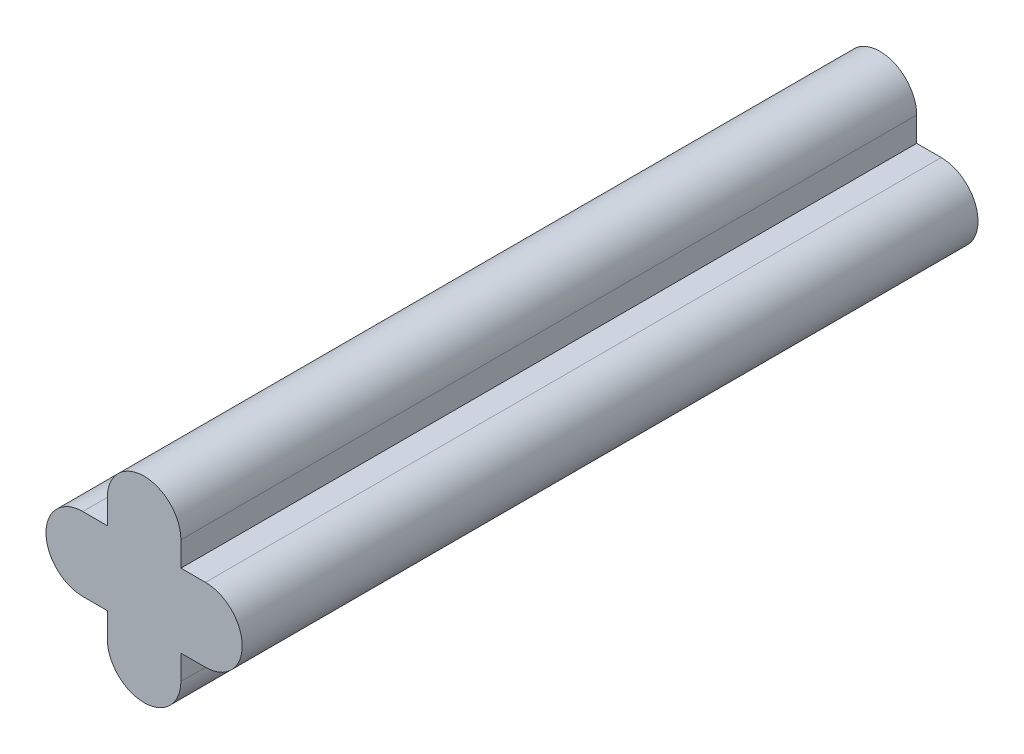
ISO-10303-21;
HEADER;
FILE_DESCRIPTION(('STEP AP214'),'2;1');
FILE_NAME('part.step','',(''),(''),'','','');
FILE_SCHEMA(('AUTOMOTIVE_DESIGN { 1 0 10303 214 1 1 1 1 }'));
ENDSEC;
DATA;
#1=APPLICATION_CONTEXT('core data for automotive mechanical design processes');
#2=APPLICATION_PROTOCOL_DEFINITION('international standard','automotive_design',2000,#1);
#3=PRODUCT_CONTEXT('',#1,'mechanical');
#4=PRODUCT('Part','Part','',(#3));
#5=PRODUCT_RELATED_PRODUCT_CATEGORY('part','',(#4));
#6=PRODUCT_DEFINITION_FORMATION('','',#4);
#7=PRODUCT_DEFINITION_CONTEXT('part definition',#1,'design');
#8=PRODUCT_DEFINITION('design','',#6,#7);
#9=PRODUCT_DEFINITION_SHAPE('','',#8);
#10=(LENGTH_UNIT() NAMED_UNIT(*) SI_UNIT(.MILLI.,.METRE.));
#11=(NAMED_UNIT(*) PLANE_ANGLE_UNIT() SI_UNIT($,.RADIAN.));
#12=(NAMED_UNIT(*) SI_UNIT($,.STERADIAN.) SOLID_ANGLE_UNIT());
#13=UNCERTAINTY_MEASURE_WITH_UNIT(LENGTH_MEASURE(1.E-05),#10,'distance_accuracy_value','');
#14=(GEOMETRIC_REPRESENTATION_CONTEXT(3) GLOBAL_UNCERTAINTY_ASSIGNED_CONTEXT((#13)) GLOBAL_UNIT_ASSIGNED_CONTEXT((#10,
#11,#12)) REPRESENTATION_CONTEXT('',''));
#15=CARTESIAN_POINT('',(0.,0.,0.));
#16=DIRECTION('',(0.,0.,1.));
#17=DIRECTION('',(1.,0.,0.));
#18=AXIS2_PLACEMENT_3D('',#15,#16,#17);
#19=CARTESIAN_POINT('',(-2.5,0.,30.));
#20=DIRECTION('',(0.,0.,-1.));
#21=DIRECTION('',(-1.,0.,0.));
#22=AXIS2_PLACEMENT_3D('',#19,#20,#21);
#23=CYLINDRICAL_SURFACE('',#22,1.5);
#24=CARTESIAN_POINT('',(-2.5,0.,0.));
#25=DIRECTION('',(0.,0.,1.));
#26=DIRECTION('',(1.,0.,0.));
#27=AXIS2_PLACEMENT_3D('',#24,#25,#26);
#28=CIRCLE('',#27,1.5);
#29=CARTESIAN_POINT('',(-2.5,1.5,0.));
#30=VERTEX_POINT('',#29);
#31=CARTESIAN_POINT('',(-2.5,-1.5,0.));
#32=VERTEX_POINT('',#31);
#33=EDGE_CURVE('E164',#30,#32,#28,.T.);
#34=ORIENTED_EDGE('',*,*,#33,.T.);
#35=DIRECTION('',(0.,0.,-1.));
#36=VECTOR('',#35,1.);
#37=CARTESIAN_POINT('',(-2.5,-1.5,30.));
#38=LINE('',#37,#36);
#39=CARTESIAN_POINT('',(-2.5,-1.5,30.));
#40=VERTEX_POINT('',#39);
#41=EDGE_CURVE('E11',#40,#32,#38,.T.);
#42=ORIENTED_EDGE('',*,*,#41,.F.);
#43=CARTESIAN_POINT('',(-2.5,0.,30.));
#44=DIRECTION('',(0.,0.,1.));
#45=DIRECTION('',(1.,0.,0.));
#46=AXIS2_PLACEMENT_3D('',#43,#44,#45);
#47=CIRCLE('',#46,1.5);
#48=CARTESIAN_POINT('',(-2.5,1.5,30.));
#49=VERTEX_POINT('',#48);
#50=EDGE_CURVE('E198',#49,#40,#47,.T.);
#51=ORIENTED_EDGE('',*,*,#50,.F.);
#52=DIRECTION('',(0.,0.,-1.));
#53=VECTOR('',#52,1.);
#54=CARTESIAN_POINT('',(-2.5,1.5,30.));
#55=LINE('',#54,#53);
#56=EDGE_CURVE('E160',#49,#30,#55,.T.);
#57=ORIENTED_EDGE('',*,*,#56,.T.);
#58=EDGE_LOOP('',(#34,#42,#51,#57));
#59=FACE_BOUND('',#58,.T.);
#60=ADVANCED_FACE('F39',(#59),#23,.T.);
#61=CARTESIAN_POINT('',(-2.5,-1.5,30.));
#62=DIRECTION('',(0.,1.,0.));
#63=DIRECTION('',(0.,0.,1.));
#64=AXIS2_PLACEMENT_3D('',#61,#62,#63);
#65=PLANE('',#64);
#66=DIRECTION('',(1.,0.,0.));
#67=VECTOR('',#66,1.);
#68=CARTESIAN_POINT('',(-2.5,-1.5,0.));
#69=LINE('',#68,#67);
#70=CARTESIAN_POINT('',(-1.5,-1.5,0.));
#71=VERTEX_POINT('',#70);
#72=EDGE_CURVE('E168',#32,#71,#69,.T.);
#73=ORIENTED_EDGE('',*,*,#72,.T.);
#74=DIRECTION('',(0.,0.,-1.));
#75=VECTOR('',#74,1.);
#76=CARTESIAN_POINT('',(-1.5,-1.5,30.));
#77=LINE('',#76,#75);
#78=CARTESIAN_POINT('',(-1.5,-1.5,30.));
#79=VERTEX_POINT('',#78);
#80=EDGE_CURVE('E48',#79,#71,#77,.T.);
#81=ORIENTED_EDGE('',*,*,#80,.F.);
#82=DIRECTION('',(1.,0.,0.));
#83=VECTOR('',#82,1.);
#84=CARTESIAN_POINT('',(-2.5,-1.5,30.));
#85=LINE('',#84,#83);
#86=EDGE_CURVE('E111',#40,#79,#85,.T.);
#87=ORIENTED_EDGE('',*,*,#86,.F.);
#88=ORIENTED_EDGE('',*,*,#41,.T.);
#89=EDGE_LOOP('',(#73,#81,#87,#88));
#90=FACE_BOUND('',#89,.T.);
#91=ADVANCED_FACE('F292',(#90),#65,.F.);
#92=CARTESIAN_POINT('',(-1.5,-1.5,30.));
#93=DIRECTION('',(1.,0.,0.));
#94=DIRECTION('',(0.,0.,-1.));
#95=AXIS2_PLACEMENT_3D('',#92,#93,#94);
#96=PLANE('',#95);
#97=DIRECTION('',(0.,-1.,0.));
#98=VECTOR('',#97,1.);
#99=CARTESIAN_POINT('',(-1.5,-1.5,0.));
#100=LINE('',#99,#98);
#101=CARTESIAN_POINT('',(-1.5,-2.5,0.));
#102=VERTEX_POINT('',#101);
#103=EDGE_CURVE('E171',#71,#102,#100,.T.);
#104=ORIENTED_EDGE('',*,*,#103,.T.);
#105=DIRECTION('',(0.,0.,-1.));
#106=VECTOR('',#105,1.);
#107=CARTESIAN_POINT('',(-1.5,-2.5,30.));
#108=LINE('',#107,#106);
#109=CARTESIAN_POINT('',(-1.5,-2.5,30.));
#110=VERTEX_POINT('',#109);
#111=EDGE_CURVE('E225',#110,#102,#108,.T.);
#112=ORIENTED_EDGE('',*,*,#111,.F.);
#113=DIRECTION('',(0.,-1.,0.));
#114=VECTOR('',#113,1.);
#115=CARTESIAN_POINT('',(-1.5,-1.5,30.));
#116=LINE('',#115,#114);
#117=EDGE_CURVE('E235',#79,#110,#116,.T.);
#118=ORIENTED_EDGE('',*,*,#117,.F.);
#119=ORIENTED_EDGE('',*,*,#80,.T.);
#120=EDGE_LOOP('',(#104,#112,#118,#119));
#121=FACE_BOUND('',#120,.T.);
#122=ADVANCED_FACE('F233',(#121),#96,.F.);
#123=CARTESIAN_POINT('',(0.,-2.5,30.));
#124=DIRECTION('',(0.,0.,-1.));
#125=DIRECTION('',(-1.,0.,0.));
#126=AXIS2_PLACEMENT_3D('',#123,#124,#125);
#127=CYLINDRICAL_SURFACE('',#126,1.5);
#128=CARTESIAN_POINT('',(0.,-2.5,0.));
#129=DIRECTION('',(0.,0.,1.));
#130=DIRECTION('',(1.,0.,0.));
#131=AXIS2_PLACEMENT_3D('',#128,#129,#130);
#132=CIRCLE('',#131,1.5);
#133=CARTESIAN_POINT('',(1.5,-2.5,0.));
#134=VERTEX_POINT('',#133);
#135=EDGE_CURVE('E174',#102,#134,#132,.T.);
#136=ORIENTED_EDGE('',*,*,#135,.T.);
#137=DIRECTION('',(0.,0.,-1.));
#138=VECTOR('',#137,1.);
#139=CARTESIAN_POINT('',(1.5,-2.5,30.));
#140=LINE('',#139,#138);
#141=CARTESIAN_POINT('',(1.5,-2.5,30.));
#142=VERTEX_POINT('',#141);
#143=EDGE_CURVE('E221',#142,#134,#140,.T.);
#144=ORIENTED_EDGE('',*,*,#143,.F.);
#145=CARTESIAN_POINT('',(0.,-2.5,30.));
#146=DIRECTION('',(0.,0.,1.));
#147=DIRECTION('',(1.,0.,0.));
#148=AXIS2_PLACEMENT_3D('',#145,#146,#147);
#149=CIRCLE('',#148,1.5);
#150=EDGE_CURVE('E254',#110,#142,#149,.T.);
#151=ORIENTED_EDGE('',*,*,#150,.F.);
#152=ORIENTED_EDGE('',*,*,#111,.T.);
#153=EDGE_LOOP('',(#136,#144,#151,#152));
#154=FACE_BOUND('',#153,.T.);
#155=ADVANCED_FACE('F244',(#154),#127,.T.);
#156=CARTESIAN_POINT('',(1.5,-1.5,30.));
#157=DIRECTION('',(-1.,0.,0.));
#158=DIRECTION('',(0.,0.,1.));
#159=AXIS2_PLACEMENT_3D('',#156,#157,#158);
#160=PLANE('',#159);
#161=DIRECTION('',(0.,1.,0.));
#162=VECTOR('',#161,1.);
#163=CARTESIAN_POINT('',(1.5,-1.5,0.));
#164=LINE('',#163,#162);
#165=CARTESIAN_POINT('',(1.5,-1.5,0.));
#166=VERTEX_POINT('',#165);
#167=EDGE_CURVE('E177',#134,#166,#164,.T.);
#168=ORIENTED_EDGE('',*,*,#167,.T.);
#169=DIRECTION('',(0.,0.,-1.));
#170=VECTOR('',#169,1.);
#171=CARTESIAN_POINT('',(1.5,-1.5,30.));
#172=LINE('',#171,#170);
#173=CARTESIAN_POINT('',(1.5,-1.5,30.));
#174=VERTEX_POINT('',#173);
#175=EDGE_CURVE('E217',#174,#166,#172,.T.);
#176=ORIENTED_EDGE('',*,*,#175,.F.);
#177=DIRECTION('',(0.,1.,0.));
#178=VECTOR('',#177,1.);
#179=CARTESIAN_POINT('',(1.5,-1.5,30.));
#180=LINE('',#179,#178);
#181=EDGE_CURVE('E250',#142,#174,#180,.T.);
#182=ORIENTED_EDGE('',*,*,#181,.F.);
#183=ORIENTED_EDGE('',*,*,#143,.T.);
#184=EDGE_LOOP('',(#168,#176,#182,#183));
#185=FACE_BOUND('',#184,.T.);
#186=ADVANCED_FACE('F248',(#185),#160,.F.);
#187=CARTESIAN_POINT('',(1.5,-1.5,30.));
#188=DIRECTION('',(0.,1.,0.));
#189=DIRECTION('',(0.,0.,1.));
#190=AXIS2_PLACEMENT_3D('',#187,#188,#189);
#191=PLANE('',#190);
#192=DIRECTION('',(1.,0.,0.));
#193=VECTOR('',#192,1.);
#194=CARTESIAN_POINT('',(1.5,-1.5,0.));
#195=LINE('',#194,#193);
#196=CARTESIAN_POINT('',(2.5,-1.5,0.));
#197=VERTEX_POINT('',#196);
#198=EDGE_CURVE('E180',#166,#197,#195,.T.);
#199=ORIENTED_EDGE('',*,*,#198,.T.);
#200=DIRECTION('',(0.,0.,-1.));
#201=VECTOR('',#200,1.);
#202=CARTESIAN_POINT('',(2.5,-1.5,30.));
#203=LINE('',#202,#201);
#204=CARTESIAN_POINT('',(2.5,-1.5,30.));
#205=VERTEX_POINT('',#204);
#206=EDGE_CURVE('E213',#205,#197,#203,.T.);
#207=ORIENTED_EDGE('',*,*,#206,.F.);
#208=DIRECTION('',(1.,0.,0.));
#209=VECTOR('',#208,1.);
#210=CARTESIAN_POINT('',(1.5,-1.5,30.));
#211=LINE('',#210,#209);
#212=EDGE_CURVE('E253',#174,#205,#211,.T.);
#213=ORIENTED_EDGE('',*,*,#212,.F.);
#214=ORIENTED_EDGE('',*,*,#175,.T.);
#215=EDGE_LOOP('',(#199,#207,#213,#214));
#216=FACE_BOUND('',#215,.T.);
#217=ADVANCED_FACE('F305',(#216),#191,.F.);
#218=CARTESIAN_POINT('',(2.5,0.,30.));
#219=DIRECTION('',(0.,0.,-1.));
#220=DIRECTION('',(-1.,0.,0.));
#221=AXIS2_PLACEMENT_3D('',#218,#219,#220);
#222=CYLINDRICAL_SURFACE('',#221,1.5);
#223=CARTESIAN_POINT('',(2.5,0.,0.));
#224=DIRECTION('',(0.,0.,1.));
#225=DIRECTION('',(1.,0.,0.));
#226=AXIS2_PLACEMENT_3D('',#223,#224,#225);
#227=CIRCLE('',#226,1.5);
#228=CARTESIAN_POINT('',(2.5,1.5,0.));
#229=VERTEX_POINT('',#228);
#230=EDGE_CURVE('E183',#197,#229,#227,.T.);
#231=ORIENTED_EDGE('',*,*,#230,.T.);
#232=DIRECTION('',(0.,0.,-1.));
#233=VECTOR('',#232,1.);
#234=CARTESIAN_POINT('',(2.5,1.5,30.));
#235=LINE('',#234,#233);
#236=CARTESIAN_POINT('',(2.5,1.5,30.));
#237=VERTEX_POINT('',#236);
#238=EDGE_CURVE('E209',#237,#229,#235,.T.);
#239=ORIENTED_EDGE('',*,*,#238,.F.);
#240=CARTESIAN_POINT('',(2.5,0.,30.));
#241=DIRECTION('',(0.,0.,1.));
#242=DIRECTION('',(1.,0.,0.));
#243=AXIS2_PLACEMENT_3D('',#240,#241,#242);
#244=CIRCLE('',#243,1.5);
#245=EDGE_CURVE('E258',#205,#237,#244,.T.);
#246=ORIENTED_EDGE('',*,*,#245,.F.);
#247=ORIENTED_EDGE('',*,*,#206,.T.);
#248=EDGE_LOOP('',(#231,#239,#246,#247));
#249=FACE_BOUND('',#248,.T.);
#250=ADVANCED_FACE('F308',(#249),#222,.T.);
#251=CARTESIAN_POINT('',(1.5,1.5,30.));
#252=DIRECTION('',(0.,-1.,0.));
#253=DIRECTION('',(0.,0.,-1.));
#254=AXIS2_PLACEMENT_3D('',#251,#252,#253);
#255=PLANE('',#254);
#256=DIRECTION('',(-1.,0.,0.));
#257=VECTOR('',#256,1.);
#258=CARTESIAN_POINT('',(1.5,1.5,0.));
#259=LINE('',#258,#257);
#260=CARTESIAN_POINT('',(1.5,1.5,0.));
#261=VERTEX_POINT('',#260);
#262=EDGE_CURVE('E186',#229,#261,#259,.T.);
#263=ORIENTED_EDGE('',*,*,#262,.T.);
#264=DIRECTION('',(0.,0.,-1.));
#265=VECTOR('',#264,1.);
#266=CARTESIAN_POINT('',(1.5,1.5,30.));
#267=LINE('',#266,#265);
#268=CARTESIAN_POINT('',(1.5,1.5,30.));
#269=VERTEX_POINT('',#268);
#270=EDGE_CURVE('E205',#269,#261,#267,.T.);
#271=ORIENTED_EDGE('',*,*,#270,.F.);
#272=DIRECTION('',(-1.,0.,0.));
#273=VECTOR('',#272,1.);
#274=CARTESIAN_POINT('',(1.5,1.5,30.));
#275=LINE('',#274,#273);
#276=EDGE_CURVE('E265',#237,#269,#275,.T.);
#277=ORIENTED_EDGE('',*,*,#276,.F.);
#278=ORIENTED_EDGE('',*,*,#238,.T.);
#279=EDGE_LOOP('',(#263,#271,#277,#278));
#280=FACE_BOUND('',#279,.T.);
#281=ADVANCED_FACE('F273',(#280),#255,.F.);
#282=CARTESIAN_POINT('',(1.5,2.5,30.));
#283=DIRECTION('',(-1.,0.,0.));
#284=DIRECTION('',(0.,0.,1.));
#285=AXIS2_PLACEMENT_3D('',#282,#283,#284);
#286=PLANE('',#285);
#287=DIRECTION('',(0.,1.,0.));
#288=VECTOR('',#287,1.);
#289=CARTESIAN_POINT('',(1.5,2.5,0.));
#290=LINE('',#289,#288);
#291=CARTESIAN_POINT('',(1.5,2.5,0.));
#292=VERTEX_POINT('',#291);
#293=EDGE_CURVE('E189',#261,#292,#290,.T.);
#294=ORIENTED_EDGE('',*,*,#293,.T.);
#295=DIRECTION('',(0.,0.,-1.));
#296=VECTOR('',#295,1.);
#297=CARTESIAN_POINT('',(1.5,2.5,30.));
#298=LINE('',#297,#296);
#299=CARTESIAN_POINT('',(1.5,2.5,30.));
#300=VERTEX_POINT('',#299);
#301=EDGE_CURVE('E153',#300,#292,#298,.T.);
#302=ORIENTED_EDGE('',*,*,#301,.F.);
#303=DIRECTION('',(0.,1.,0.));
#304=VECTOR('',#303,1.);
#305=CARTESIAN_POINT('',(1.5,2.5,30.));
#306=LINE('',#305,#304);
#307=EDGE_CURVE('E142',#269,#300,#306,.T.);
#308=ORIENTED_EDGE('',*,*,#307,.F.);
#309=ORIENTED_EDGE('',*,*,#270,.T.);
#310=EDGE_LOOP('',(#294,#302,#308,#309));
#311=FACE_BOUND('',#310,.T.);
#312=ADVANCED_FACE('F277',(#311),#286,.F.);
#313=CARTESIAN_POINT('',(0.,2.5,30.));
#314=DIRECTION('',(0.,0.,-1.));
#315=DIRECTION('',(-1.,0.,0.));
#316=AXIS2_PLACEMENT_3D('',#313,#314,#315);
#317=CYLINDRICAL_SURFACE('',#316,1.5);
#318=CARTESIAN_POINT('',(0.,2.5,0.));
#319=DIRECTION('',(0.,0.,1.));
#320=DIRECTION('',(1.,0.,0.));
#321=AXIS2_PLACEMENT_3D('',#318,#319,#320);
#322=CIRCLE('',#321,1.5);
#323=CARTESIAN_POINT('',(-1.5,2.5,0.));
#324=VERTEX_POINT('',#323);
#325=EDGE_CURVE('E151',#292,#324,#322,.T.);
#326=ORIENTED_EDGE('',*,*,#325,.T.);
#327=DIRECTION('',(0.,0.,-1.));
#328=VECTOR('',#327,1.);
#329=CARTESIAN_POINT('',(-1.5,2.5,30.));
#330=LINE('',#329,#328);
#331=CARTESIAN_POINT('',(-1.5,2.5,30.));
#332=VERTEX_POINT('',#331);
#333=EDGE_CURVE('E148',#332,#324,#330,.T.);
#334=ORIENTED_EDGE('',*,*,#333,.F.);
#335=CARTESIAN_POINT('',(0.,2.5,30.));
#336=DIRECTION('',(0.,0.,1.));
#337=DIRECTION('',(1.,0.,0.));
#338=AXIS2_PLACEMENT_3D('',#335,#336,#337);
#339=CIRCLE('',#338,1.5);
#340=EDGE_CURVE('E136',#300,#332,#339,.T.);
#341=ORIENTED_EDGE('',*,*,#340,.F.);
#342=ORIENTED_EDGE('',*,*,#301,.T.);
#343=EDGE_LOOP('',(#326,#334,#341,#342));
#344=FACE_BOUND('',#343,.T.);
#345=ADVANCED_FACE('F149',(#344),#317,.T.);
#346=CARTESIAN_POINT('',(-1.5,2.5,30.));
#347=DIRECTION('',(1.,0.,0.));
#348=DIRECTION('',(0.,0.,-1.));
#349=AXIS2_PLACEMENT_3D('',#346,#347,#348);
#350=PLANE('',#349);
#351=DIRECTION('',(0.,-1.,0.));
#352=VECTOR('',#351,1.);
#353=CARTESIAN_POINT('',(-1.5,2.5,0.));
#354=LINE('',#353,#352);
#355=CARTESIAN_POINT('',(-1.5,1.5,0.));
#356=VERTEX_POINT('',#355);
#357=EDGE_CURVE('E97',#324,#356,#354,.T.);
#358=ORIENTED_EDGE('',*,*,#357,.T.);
#359=DIRECTION('',(0.,0.,-1.));
#360=VECTOR('',#359,1.);
#361=CARTESIAN_POINT('',(-1.5,1.5,30.));
#362=LINE('',#361,#360);
#363=CARTESIAN_POINT('',(-1.5,1.5,30.));
#364=VERTEX_POINT('',#363);
#365=EDGE_CURVE('E154',#364,#356,#362,.T.);
#366=ORIENTED_EDGE('',*,*,#365,.F.);
#367=DIRECTION('',(0.,-1.,0.));
#368=VECTOR('',#367,1.);
#369=CARTESIAN_POINT('',(-1.5,2.5,30.));
#370=LINE('',#369,#368);
#371=EDGE_CURVE('E140',#332,#364,#370,.T.);
#372=ORIENTED_EDGE('',*,*,#371,.F.);
#373=ORIENTED_EDGE('',*,*,#333,.T.);
#374=EDGE_LOOP('',(#358,#366,#372,#373));
#375=FACE_BOUND('',#374,.T.);
#376=ADVANCED_FACE('F156',(#375),#350,.F.);
#377=CARTESIAN_POINT('',(-2.5,1.5,30.));
#378=DIRECTION('',(0.,-1.,0.));
#379=DIRECTION('',(0.,0.,-1.));
#380=AXIS2_PLACEMENT_3D('',#377,#378,#379);
#381=PLANE('',#380);
#382=DIRECTION('',(-1.,0.,0.));
#383=VECTOR('',#382,1.);
#384=CARTESIAN_POINT('',(-2.5,1.5,0.));
#385=LINE('',#384,#383);
#386=EDGE_CURVE('E103',#356,#30,#385,.T.);
#387=ORIENTED_EDGE('',*,*,#386,.T.);
#388=ORIENTED_EDGE('',*,*,#56,.F.);
#389=DIRECTION('',(-1.,0.,0.));
#390=VECTOR('',#389,1.);
#391=CARTESIAN_POINT('',(-2.5,1.5,30.));
#392=LINE('',#391,#390);
#393=EDGE_CURVE('E56',#364,#49,#392,.T.);
#394=ORIENTED_EDGE('',*,*,#393,.F.);
#395=ORIENTED_EDGE('',*,*,#365,.T.);
#396=EDGE_LOOP('',(#387,#388,#394,#395));
#397=FACE_BOUND('',#396,.T.);
#398=ADVANCED_FACE('F281',(#397),#381,.F.);
#399=CARTESIAN_POINT('',(-2.5,0.,30.));
#400=DIRECTION('',(0.,0.,1.));
#401=DIRECTION('',(1.,0.,0.));
#402=AXIS2_PLACEMENT_3D('',#399,#400,#401);
#403=PLANE('',#402);
#404=ORIENTED_EDGE('',*,*,#50,.T.);
#405=ORIENTED_EDGE('',*,*,#86,.T.);
#406=ORIENTED_EDGE('',*,*,#117,.T.);
#407=ORIENTED_EDGE('',*,*,#150,.T.);
#408=ORIENTED_EDGE('',*,*,#181,.T.);
#409=ORIENTED_EDGE('',*,*,#212,.T.);
#410=ORIENTED_EDGE('',*,*,#245,.T.);
#411=ORIENTED_EDGE('',*,*,#276,.T.);
#412=ORIENTED_EDGE('',*,*,#307,.T.);
#413=ORIENTED_EDGE('',*,*,#340,.T.);
#414=ORIENTED_EDGE('',*,*,#371,.T.);
#415=ORIENTED_EDGE('',*,*,#393,.T.);
#416=EDGE_LOOP('',(#404,#405,#406,#407,#408,#409,#410,#411,#412,#413,#414,#415));
#417=FACE_BOUND('',#416,.T.);
#418=ADVANCED_FACE('F138',(#417),#403,.T.);
#419=CARTESIAN_POINT('',(-2.5,0.,0.));
#420=DIRECTION('',(0.,0.,1.));
#421=DIRECTION('',(1.,0.,0.));
#422=AXIS2_PLACEMENT_3D('',#419,#420,#421);
#423=PLANE('',#422);
#424=ORIENTED_EDGE('',*,*,#33,.F.);
#425=ORIENTED_EDGE('',*,*,#386,.F.);
#426=ORIENTED_EDGE('',*,*,#357,.F.);
#427=ORIENTED_EDGE('',*,*,#325,.F.);
#428=ORIENTED_EDGE('',*,*,#293,.F.);
#429=ORIENTED_EDGE('',*,*,#262,.F.);
#430=ORIENTED_EDGE('',*,*,#230,.F.);
#431=ORIENTED_EDGE('',*,*,#198,.F.);
#432=ORIENTED_EDGE('',*,*,#167,.F.);
#433=ORIENTED_EDGE('',*,*,#135,.F.);
#434=ORIENTED_EDGE('',*,*,#103,.F.);
#435=ORIENTED_EDGE('',*,*,#72,.F.);
#436=EDGE_LOOP('',(#424,#425,#426,#427,#428,#429,#430,#431,#432,#433,#434,#435));
#437=FACE_BOUND('',#436,.T.);
#438=ADVANCED_FACE('F239',(#437),#423,.F.);
#439=CLOSED_SHELL('',(#60,#91,#122,#155,#186,#217,#250,#281,#312,#345,#376,#398,#418,#438));
#440=MANIFOLD_SOLID_BREP('B2',#439);
#441=ADVANCED_BREP_SHAPE_REPRESENTATION('',(#18,#440),#14);
#442=SHAPE_DEFINITION_REPRESENTATION(#9,#441);
ENDSEC;
END-ISO-10303-21;
